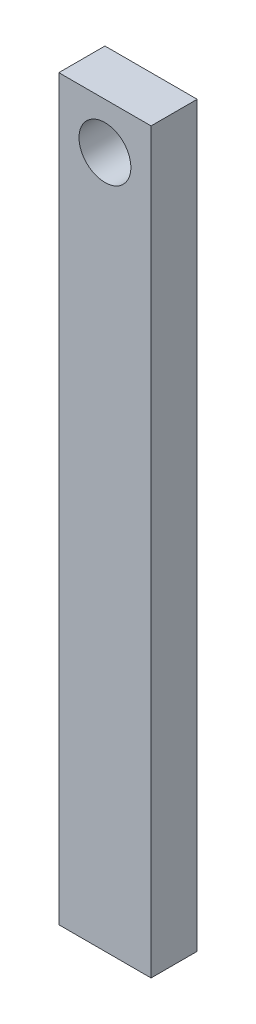
ISO-10303-21;
HEADER;
FILE_DESCRIPTION(('STEP AP214'),'2;1');
FILE_NAME('part.step','',(''),(''),'','','');
FILE_SCHEMA(('AUTOMOTIVE_DESIGN { 1 0 10303 214 1 1 1 1 }'));
ENDSEC;
DATA;
#1=APPLICATION_CONTEXT('core data for automotive mechanical design processes');
#2=APPLICATION_PROTOCOL_DEFINITION('international standard','automotive_design',2000,#1);
#3=PRODUCT_CONTEXT('',#1,'mechanical');
#4=PRODUCT('Part','Part','',(#3));
#5=PRODUCT_RELATED_PRODUCT_CATEGORY('part','',(#4));
#6=PRODUCT_DEFINITION_FORMATION('','',#4);
#7=PRODUCT_DEFINITION_CONTEXT('part definition',#1,'design');
#8=PRODUCT_DEFINITION('design','',#6,#7);
#9=PRODUCT_DEFINITION_SHAPE('','',#8);
#10=(LENGTH_UNIT() NAMED_UNIT(*) SI_UNIT(.MILLI.,.METRE.));
#11=(NAMED_UNIT(*) PLANE_ANGLE_UNIT() SI_UNIT($,.RADIAN.));
#12=(NAMED_UNIT(*) SI_UNIT($,.STERADIAN.) SOLID_ANGLE_UNIT());
#13=UNCERTAINTY_MEASURE_WITH_UNIT(LENGTH_MEASURE(1.E-05),#10,'distance_accuracy_value','');
#14=(GEOMETRIC_REPRESENTATION_CONTEXT(3) GLOBAL_UNCERTAINTY_ASSIGNED_CONTEXT((#13)) GLOBAL_UNIT_ASSIGNED_CONTEXT((#10,
#11,#12)) REPRESENTATION_CONTEXT('',''));
#15=CARTESIAN_POINT('',(0.,0.,0.));
#16=DIRECTION('',(0.,0.,1.));
#17=DIRECTION('',(1.,0.,0.));
#18=AXIS2_PLACEMENT_3D('',#15,#16,#17);
#19=CARTESIAN_POINT('',(0.,0.,25.4));
#20=DIRECTION('',(0.,0.,-1.));
#21=DIRECTION('',(-1.,0.,0.));
#22=AXIS2_PLACEMENT_3D('',#19,#20,#21);
#23=PLANE('',#22);
#24=DIRECTION('',(0.,-1.,0.));
#25=VECTOR('',#24,1.);
#26=CARTESIAN_POINT('',(0.,0.,25.4));
#27=LINE('',#26,#25);
#28=CARTESIAN_POINT('',(0.,406.4,25.4));
#29=VERTEX_POINT('',#28);
#30=CARTESIAN_POINT('',(0.,0.,25.4));
#31=VERTEX_POINT('',#30);
#32=EDGE_CURVE('E93',#29,#31,#27,.T.);
#33=ORIENTED_EDGE('',*,*,#32,.T.);
#34=DIRECTION('',(1.,0.,0.));
#35=VECTOR('',#34,1.);
#36=CARTESIAN_POINT('',(0.,0.,25.4));
#37=LINE('',#36,#35);
#38=CARTESIAN_POINT('',(50.8,0.,25.4));
#39=VERTEX_POINT('',#38);
#40=EDGE_CURVE('E88',#31,#39,#37,.T.);
#41=ORIENTED_EDGE('',*,*,#40,.T.);
#42=DIRECTION('',(0.,1.,0.));
#43=VECTOR('',#42,1.);
#44=CARTESIAN_POINT('',(50.8,0.,25.4));
#45=LINE('',#44,#43);
#46=CARTESIAN_POINT('',(50.8,406.4,25.4));
#47=VERTEX_POINT('',#46);
#48=EDGE_CURVE('E91',#39,#47,#45,.T.);
#49=ORIENTED_EDGE('',*,*,#48,.T.);
#50=DIRECTION('',(-1.,0.,0.));
#51=VECTOR('',#50,1.);
#52=CARTESIAN_POINT('',(0.,406.4,25.4));
#53=LINE('',#52,#51);
#54=EDGE_CURVE('E58',#47,#29,#53,.T.);
#55=ORIENTED_EDGE('',*,*,#54,.T.);
#56=EDGE_LOOP('',(#33,#41,#49,#55));
#57=FACE_BOUND('',#56,.T.);
#58=CARTESIAN_POINT('',(25.4,381.,25.4));
#59=DIRECTION('',(0.,0.,1.));
#60=DIRECTION('',(1.,0.,0.));
#61=AXIS2_PLACEMENT_3D('',#58,#59,#60);
#62=CIRCLE('',#61,14.2875);
#63=CARTESIAN_POINT('',(39.6875,381.,25.4));
#64=VERTEX_POINT('',#63);
#65=EDGE_CURVE('E108',#64,#64,#62,.T.);
#66=ORIENTED_EDGE('',*,*,#65,.F.);
#67=EDGE_LOOP('',(#66));
#68=FACE_BOUND('',#67,.T.);
#69=ADVANCED_FACE('F41',(#57,#68),#23,.F.);
#70=CARTESIAN_POINT('',(0.,0.,0.));
#71=DIRECTION('',(0.,0.,-1.));
#72=DIRECTION('',(-1.,0.,0.));
#73=AXIS2_PLACEMENT_3D('',#70,#71,#72);
#74=PLANE('',#73);
#75=DIRECTION('',(0.,-1.,0.));
#76=VECTOR('',#75,1.);
#77=CARTESIAN_POINT('',(0.,0.,0.));
#78=LINE('',#77,#76);
#79=CARTESIAN_POINT('',(0.,406.4,0.));
#80=VERTEX_POINT('',#79);
#81=CARTESIAN_POINT('',(0.,0.,0.));
#82=VERTEX_POINT('',#81);
#83=EDGE_CURVE('E105',#80,#82,#78,.T.);
#84=ORIENTED_EDGE('',*,*,#83,.F.);
#85=DIRECTION('',(-1.,0.,0.));
#86=VECTOR('',#85,1.);
#87=CARTESIAN_POINT('',(0.,406.4,0.));
#88=LINE('',#87,#86);
#89=CARTESIAN_POINT('',(50.8,406.4,0.));
#90=VERTEX_POINT('',#89);
#91=EDGE_CURVE('E81',#90,#80,#88,.T.);
#92=ORIENTED_EDGE('',*,*,#91,.F.);
#93=DIRECTION('',(0.,1.,0.));
#94=VECTOR('',#93,1.);
#95=CARTESIAN_POINT('',(50.8,0.,0.));
#96=LINE('',#95,#94);
#97=CARTESIAN_POINT('',(50.8,0.,0.));
#98=VERTEX_POINT('',#97);
#99=EDGE_CURVE('E75',#98,#90,#96,.T.);
#100=ORIENTED_EDGE('',*,*,#99,.F.);
#101=DIRECTION('',(1.,0.,0.));
#102=VECTOR('',#101,1.);
#103=CARTESIAN_POINT('',(0.,0.,0.));
#104=LINE('',#103,#102);
#105=EDGE_CURVE('E97',#82,#98,#104,.T.);
#106=ORIENTED_EDGE('',*,*,#105,.F.);
#107=EDGE_LOOP('',(#84,#92,#100,#106));
#108=FACE_BOUND('',#107,.T.);
#109=CARTESIAN_POINT('',(25.4,381.,0.));
#110=DIRECTION('',(0.,0.,1.));
#111=DIRECTION('',(1.,0.,0.));
#112=AXIS2_PLACEMENT_3D('',#109,#110,#111);
#113=CIRCLE('',#112,14.2875);
#114=CARTESIAN_POINT('',(39.6875,381.,0.));
#115=VERTEX_POINT('',#114);
#116=EDGE_CURVE('E120',#115,#115,#113,.T.);
#117=ORIENTED_EDGE('',*,*,#116,.T.);
#118=EDGE_LOOP('',(#117));
#119=FACE_BOUND('',#118,.T.);
#120=ADVANCED_FACE('F116',(#108,#119),#74,.T.);
#121=CARTESIAN_POINT('',(0.,0.,25.4));
#122=DIRECTION('',(1.,0.,0.));
#123=DIRECTION('',(0.,0.,-1.));
#124=AXIS2_PLACEMENT_3D('',#121,#122,#123);
#125=PLANE('',#124);
#126=ORIENTED_EDGE('',*,*,#83,.T.);
#127=DIRECTION('',(0.,0.,-1.));
#128=VECTOR('',#127,1.);
#129=CARTESIAN_POINT('',(0.,0.,25.4));
#130=LINE('',#129,#128);
#131=EDGE_CURVE('E11',#31,#82,#130,.T.);
#132=ORIENTED_EDGE('',*,*,#131,.F.);
#133=ORIENTED_EDGE('',*,*,#32,.F.);
#134=DIRECTION('',(0.,0.,-1.));
#135=VECTOR('',#134,1.);
#136=CARTESIAN_POINT('',(0.,406.4,25.4));
#137=LINE('',#136,#135);
#138=EDGE_CURVE('E101',#29,#80,#137,.T.);
#139=ORIENTED_EDGE('',*,*,#138,.T.);
#140=EDGE_LOOP('',(#126,#132,#133,#139));
#141=FACE_BOUND('',#140,.T.);
#142=ADVANCED_FACE('F43',(#141),#125,.F.);
#143=CARTESIAN_POINT('',(0.,0.,25.4));
#144=DIRECTION('',(0.,1.,0.));
#145=DIRECTION('',(0.,0.,1.));
#146=AXIS2_PLACEMENT_3D('',#143,#144,#145);
#147=PLANE('',#146);
#148=ORIENTED_EDGE('',*,*,#105,.T.);
#149=DIRECTION('',(0.,0.,-1.));
#150=VECTOR('',#149,1.);
#151=CARTESIAN_POINT('',(50.8,0.,25.4));
#152=LINE('',#151,#150);
#153=EDGE_CURVE('E50',#39,#98,#152,.T.);
#154=ORIENTED_EDGE('',*,*,#153,.F.);
#155=ORIENTED_EDGE('',*,*,#40,.F.);
#156=ORIENTED_EDGE('',*,*,#131,.T.);
#157=EDGE_LOOP('',(#148,#154,#155,#156));
#158=FACE_BOUND('',#157,.T.);
#159=ADVANCED_FACE('F96',(#158),#147,.F.);
#160=CARTESIAN_POINT('',(50.8,0.,25.4));
#161=DIRECTION('',(-1.,0.,0.));
#162=DIRECTION('',(0.,0.,1.));
#163=AXIS2_PLACEMENT_3D('',#160,#161,#162);
#164=PLANE('',#163);
#165=ORIENTED_EDGE('',*,*,#99,.T.);
#166=DIRECTION('',(0.,0.,-1.));
#167=VECTOR('',#166,1.);
#168=CARTESIAN_POINT('',(50.8,406.4,25.4));
#169=LINE('',#168,#167);
#170=EDGE_CURVE('E98',#47,#90,#169,.T.);
#171=ORIENTED_EDGE('',*,*,#170,.F.);
#172=ORIENTED_EDGE('',*,*,#48,.F.);
#173=ORIENTED_EDGE('',*,*,#153,.T.);
#174=EDGE_LOOP('',(#165,#171,#172,#173));
#175=FACE_BOUND('',#174,.T.);
#176=ADVANCED_FACE('F99',(#175),#164,.F.);
#177=CARTESIAN_POINT('',(0.,406.4,25.4));
#178=DIRECTION('',(0.,-1.,0.));
#179=DIRECTION('',(0.,0.,-1.));
#180=AXIS2_PLACEMENT_3D('',#177,#178,#179);
#181=PLANE('',#180);
#182=ORIENTED_EDGE('',*,*,#91,.T.);
#183=ORIENTED_EDGE('',*,*,#138,.F.);
#184=ORIENTED_EDGE('',*,*,#54,.F.);
#185=ORIENTED_EDGE('',*,*,#170,.T.);
#186=EDGE_LOOP('',(#182,#183,#184,#185));
#187=FACE_BOUND('',#186,.T.);
#188=ADVANCED_FACE('F113',(#187),#181,.F.);
#189=CARTESIAN_POINT('',(25.4,381.,25.4));
#190=DIRECTION('',(0.,0.,-1.));
#191=DIRECTION('',(-1.,0.,0.));
#192=AXIS2_PLACEMENT_3D('',#189,#190,#191);
#193=CYLINDRICAL_SURFACE('',#192,14.2875);
#194=ORIENTED_EDGE('',*,*,#65,.T.);
#195=EDGE_LOOP('',(#194));
#196=FACE_BOUND('',#195,.T.);
#197=ORIENTED_EDGE('',*,*,#116,.F.);
#198=EDGE_LOOP('',(#197));
#199=FACE_BOUND('',#198,.T.);
#200=ADVANCED_FACE('F126',(#196,#199),#193,.F.);
#201=CLOSED_SHELL('',(#69,#120,#142,#159,#176,#188,#200));
#202=MANIFOLD_SOLID_BREP('B2',#201);
#203=ADVANCED_BREP_SHAPE_REPRESENTATION('',(#18,#202),#14);
#204=SHAPE_DEFINITION_REPRESENTATION(#9,#203);
ENDSEC;
END-ISO-10303-21;
